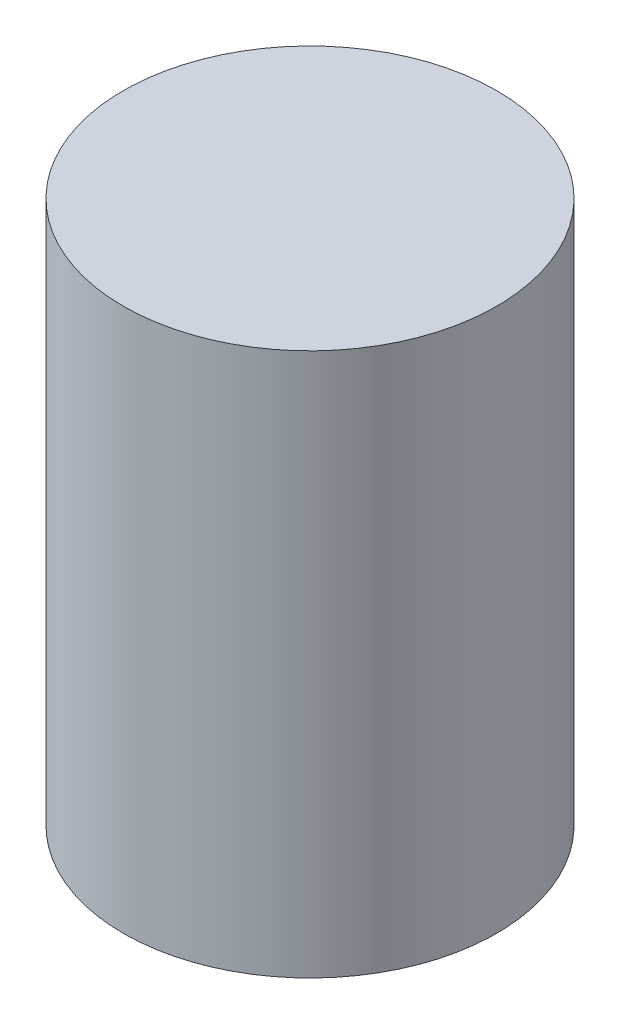
ISO-10303-21;
HEADER;
FILE_DESCRIPTION(('STEP AP214'),'2;1');
FILE_NAME('part.step','',(''),(''),'','','');
FILE_SCHEMA(('AUTOMOTIVE_DESIGN { 1 0 10303 214 1 1 1 1 }'));
ENDSEC;
DATA;
#1=APPLICATION_CONTEXT('core data for automotive mechanical design processes');
#2=APPLICATION_PROTOCOL_DEFINITION('international standard','automotive_design',2000,#1);
#3=PRODUCT_CONTEXT('',#1,'mechanical');
#4=PRODUCT('Part','Part','',(#3));
#5=PRODUCT_RELATED_PRODUCT_CATEGORY('part','',(#4));
#6=PRODUCT_DEFINITION_FORMATION('','',#4);
#7=PRODUCT_DEFINITION_CONTEXT('part definition',#1,'design');
#8=PRODUCT_DEFINITION('design','',#6,#7);
#9=PRODUCT_DEFINITION_SHAPE('','',#8);
#10=(LENGTH_UNIT() NAMED_UNIT(*) SI_UNIT(.MILLI.,.METRE.));
#11=(NAMED_UNIT(*) PLANE_ANGLE_UNIT() SI_UNIT($,.RADIAN.));
#12=(NAMED_UNIT(*) SI_UNIT($,.STERADIAN.) SOLID_ANGLE_UNIT());
#13=UNCERTAINTY_MEASURE_WITH_UNIT(LENGTH_MEASURE(1.E-05),#10,'distance_accuracy_value','');
#14=(GEOMETRIC_REPRESENTATION_CONTEXT(3) GLOBAL_UNCERTAINTY_ASSIGNED_CONTEXT((#13)) GLOBAL_UNIT_ASSIGNED_CONTEXT((#10,
#11,#12)) REPRESENTATION_CONTEXT('',''));
#15=CARTESIAN_POINT('',(0.,0.,0.));
#16=DIRECTION('',(0.,0.,1.));
#17=DIRECTION('',(1.,0.,0.));
#18=AXIS2_PLACEMENT_3D('',#15,#16,#17);
#19=CARTESIAN_POINT('',(0.,40.,0.));
#20=DIRECTION('',(0.,-1.,0.));
#21=DIRECTION('',(0.,0.,-1.));
#22=AXIS2_PLACEMENT_3D('',#19,#20,#21);
#23=CYLINDRICAL_SURFACE('',#22,13.75);
#24=CARTESIAN_POINT('',(0.,40.,0.));
#25=DIRECTION('',(0.,1.,0.));
#26=DIRECTION('',(0.,0.,1.));
#27=AXIS2_PLACEMENT_3D('',#24,#25,#26);
#28=CIRCLE('',#27,13.75);
#29=CARTESIAN_POINT('',(0.,40.,13.75));
#30=VERTEX_POINT('',#29);
#31=EDGE_CURVE('E10',#30,#30,#28,.T.);
#32=ORIENTED_EDGE('',*,*,#31,.F.);
#33=EDGE_LOOP('',(#32));
#34=FACE_BOUND('',#33,.T.);
#35=CARTESIAN_POINT('',(0.,0.,0.));
#36=DIRECTION('',(0.,1.,0.));
#37=DIRECTION('',(0.,0.,1.));
#38=AXIS2_PLACEMENT_3D('',#35,#36,#37);
#39=CIRCLE('',#38,13.75);
#40=CARTESIAN_POINT('',(0.,0.,13.75));
#41=VERTEX_POINT('',#40);
#42=EDGE_CURVE('E42',#41,#41,#39,.T.);
#43=ORIENTED_EDGE('',*,*,#42,.T.);
#44=EDGE_LOOP('',(#43));
#45=FACE_BOUND('',#44,.T.);
#46=ADVANCED_FACE('F39',(#34,#45),#23,.T.);
#47=CARTESIAN_POINT('',(0.,40.,0.));
#48=DIRECTION('',(0.,1.,0.));
#49=DIRECTION('',(0.,0.,1.));
#50=AXIS2_PLACEMENT_3D('',#47,#48,#49);
#51=PLANE('',#50);
#52=ORIENTED_EDGE('',*,*,#31,.T.);
#53=EDGE_LOOP('',(#52));
#54=FACE_BOUND('',#53,.T.);
#55=ADVANCED_FACE('F54',(#54),#51,.T.);
#56=CARTESIAN_POINT('',(0.,0.,0.));
#57=DIRECTION('',(0.,1.,0.));
#58=DIRECTION('',(0.,0.,1.));
#59=AXIS2_PLACEMENT_3D('',#56,#57,#58);
#60=PLANE('',#59);
#61=ORIENTED_EDGE('',*,*,#42,.F.);
#62=EDGE_LOOP('',(#61));
#63=FACE_BOUND('',#62,.T.);
#64=ADVANCED_FACE('F52',(#63),#60,.F.);
#65=CLOSED_SHELL('',(#46,#55,#64));
#66=MANIFOLD_SOLID_BREP('B2',#65);
#67=ADVANCED_BREP_SHAPE_REPRESENTATION('',(#18,#66),#14);
#68=SHAPE_DEFINITION_REPRESENTATION(#9,#67);
ENDSEC;
END-ISO-10303-21;
